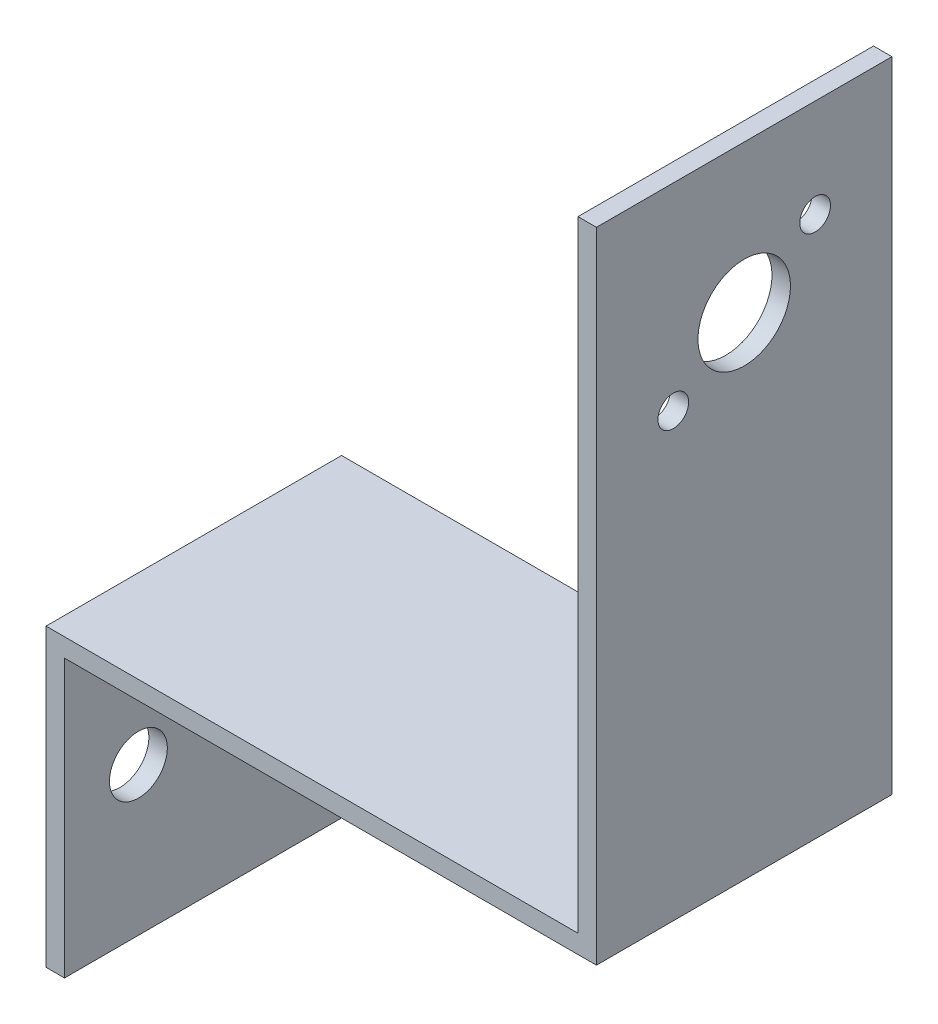
ISO-10303-21;
HEADER;
FILE_DESCRIPTION(('STEP AP214'),'2;1');
FILE_NAME('part.step','',(''),(''),'','','');
FILE_SCHEMA(('AUTOMOTIVE_DESIGN { 1 0 10303 214 1 1 1 1 }'));
ENDSEC;
DATA;
#1=APPLICATION_CONTEXT('core data for automotive mechanical design processes');
#2=APPLICATION_PROTOCOL_DEFINITION('international standard','automotive_design',2000,#1);
#3=PRODUCT_CONTEXT('',#1,'mechanical');
#4=PRODUCT('Part','Part','',(#3));
#5=PRODUCT_RELATED_PRODUCT_CATEGORY('part','',(#4));
#6=PRODUCT_DEFINITION_FORMATION('','',#4);
#7=PRODUCT_DEFINITION_CONTEXT('part definition',#1,'design');
#8=PRODUCT_DEFINITION('design','',#6,#7);
#9=PRODUCT_DEFINITION_SHAPE('','',#8);
#10=(LENGTH_UNIT() NAMED_UNIT(*) SI_UNIT(.MILLI.,.METRE.));
#11=(NAMED_UNIT(*) PLANE_ANGLE_UNIT() SI_UNIT($,.RADIAN.));
#12=(NAMED_UNIT(*) SI_UNIT($,.STERADIAN.) SOLID_ANGLE_UNIT());
#13=UNCERTAINTY_MEASURE_WITH_UNIT(LENGTH_MEASURE(1.E-05),#10,'distance_accuracy_value','');
#14=(GEOMETRIC_REPRESENTATION_CONTEXT(3) GLOBAL_UNCERTAINTY_ASSIGNED_CONTEXT((#13)) GLOBAL_UNIT_ASSIGNED_CONTEXT((#10,
#11,#12)) REPRESENTATION_CONTEXT('',''));
#15=CARTESIAN_POINT('',(0.,0.,0.));
#16=DIRECTION('',(0.,0.,1.));
#17=DIRECTION('',(1.,0.,0.));
#18=AXIS2_PLACEMENT_3D('',#15,#16,#17);
#19=CARTESIAN_POINT('',(47.307499936,25.4,25.4));
#20=DIRECTION('',(-1.,0.,0.));
#21=DIRECTION('',(0.,0.,1.));
#22=AXIS2_PLACEMENT_3D('',#19,#20,#21);
#23=PLANE('',#22);
#24=CARTESIAN_POINT('',(47.307499936,70.3086705546117,6.60370665599244));
#25=DIRECTION('',(1.,0.,0.));
#26=DIRECTION('',(0.,0.,-1.));
#27=AXIS2_PLACEMENT_3D('',#24,#25,#26);
#28=CIRCLE('',#27,1.3208);
#29=CARTESIAN_POINT('',(47.307499936,70.3086705546117,5.28290665599244));
#30=VERTEX_POINT('',#29);
#31=EDGE_CURVE('E202',#30,#30,#28,.T.);
#32=ORIENTED_EDGE('',*,*,#31,.F.);
#33=EDGE_LOOP('',(#32));
#34=FACE_BOUND('',#33,.T.);
#35=CARTESIAN_POINT('',(47.307499936,61.7713294453883,18.7962933440076));
#36=DIRECTION('',(1.,0.,0.));
#37=DIRECTION('',(0.,0.,-1.));
#38=AXIS2_PLACEMENT_3D('',#35,#36,#37);
#39=CIRCLE('',#38,1.32080000000001);
#40=CARTESIAN_POINT('',(47.307499936,61.7713294453883,17.4754933440075));
#41=VERTEX_POINT('',#40);
#42=EDGE_CURVE('E201',#41,#41,#39,.T.);
#43=ORIENTED_EDGE('',*,*,#42,.F.);
#44=EDGE_LOOP('',(#43));
#45=FACE_BOUND('',#44,.T.);
#46=CARTESIAN_POINT('',(47.307499936,66.04,12.7));
#47=DIRECTION('',(1.,0.,0.));
#48=DIRECTION('',(0.,0.,-1.));
#49=AXIS2_PLACEMENT_3D('',#46,#47,#48);
#50=CIRCLE('',#49,3.97509999999999);
#51=CARTESIAN_POINT('',(47.307499936,66.04,8.72490000000001));
#52=VERTEX_POINT('',#51);
#53=EDGE_CURVE('E162',#52,#52,#50,.T.);
#54=ORIENTED_EDGE('',*,*,#53,.F.);
#55=EDGE_LOOP('',(#54));
#56=FACE_BOUND('',#55,.T.);
#57=DIRECTION('',(0.,1.,0.));
#58=VECTOR('',#57,1.);
#59=CARTESIAN_POINT('',(47.307499936,25.4,0.));
#60=LINE('',#59,#58);
#61=CARTESIAN_POINT('',(47.307499936,23.8125,0.));
#62=VERTEX_POINT('',#61);
#63=CARTESIAN_POINT('',(47.307499936,78.74,0.));
#64=VERTEX_POINT('',#63);
#65=EDGE_CURVE('E133',#62,#64,#60,.T.);
#66=ORIENTED_EDGE('',*,*,#65,.T.);
#67=DIRECTION('',(0.,0.,-1.));
#68=VECTOR('',#67,1.);
#69=CARTESIAN_POINT('',(47.307499936,78.74,25.4));
#70=LINE('',#69,#68);
#71=CARTESIAN_POINT('',(47.307499936,78.74,25.4));
#72=VERTEX_POINT('',#71);
#73=EDGE_CURVE('E11',#72,#64,#70,.T.);
#74=ORIENTED_EDGE('',*,*,#73,.F.);
#75=DIRECTION('',(0.,1.,0.));
#76=VECTOR('',#75,1.);
#77=CARTESIAN_POINT('',(47.307499936,25.4,25.4));
#78=LINE('',#77,#76);
#79=CARTESIAN_POINT('',(47.307499936,23.8125,25.4));
#80=VERTEX_POINT('',#79);
#81=EDGE_CURVE('E91',#80,#72,#78,.T.);
#82=ORIENTED_EDGE('',*,*,#81,.F.);
#83=DIRECTION('',(0.,0.,-1.));
#84=VECTOR('',#83,1.);
#85=CARTESIAN_POINT('',(47.307499936,23.8125,25.4));
#86=LINE('',#85,#84);
#87=EDGE_CURVE('E132',#80,#62,#86,.T.);
#88=ORIENTED_EDGE('',*,*,#87,.T.);
#89=EDGE_LOOP('',(#66,#74,#82,#88));
#90=FACE_BOUND('',#89,.T.);
#91=ADVANCED_FACE('F34',(#34,#45,#56,#90),#23,.F.);
#92=CARTESIAN_POINT('',(45.719999936,78.74,25.4));
#93=DIRECTION('',(0.,1.,0.));
#94=DIRECTION('',(0.,0.,1.));
#95=AXIS2_PLACEMENT_3D('',#92,#93,#94);
#96=PLANE('',#95);
#97=DIRECTION('',(1.,0.,0.));
#98=VECTOR('',#97,1.);
#99=CARTESIAN_POINT('',(45.719999936,78.74,0.));
#100=LINE('',#99,#98);
#101=CARTESIAN_POINT('',(45.719999936,78.74,0.));
#102=VERTEX_POINT('',#101);
#103=EDGE_CURVE('E136',#102,#64,#100,.T.);
#104=ORIENTED_EDGE('',*,*,#103,.F.);
#105=DIRECTION('',(0.,0.,-1.));
#106=VECTOR('',#105,1.);
#107=CARTESIAN_POINT('',(45.719999936,78.74,25.4));
#108=LINE('',#107,#106);
#109=CARTESIAN_POINT('',(45.719999936,78.74,25.4));
#110=VERTEX_POINT('',#109);
#111=EDGE_CURVE('E43',#110,#102,#108,.T.);
#112=ORIENTED_EDGE('',*,*,#111,.F.);
#113=DIRECTION('',(1.,0.,0.));
#114=VECTOR('',#113,1.);
#115=CARTESIAN_POINT('',(45.719999936,78.74,25.4));
#116=LINE('',#115,#114);
#117=EDGE_CURVE('E193',#110,#72,#116,.T.);
#118=ORIENTED_EDGE('',*,*,#117,.T.);
#119=ORIENTED_EDGE('',*,*,#73,.T.);
#120=EDGE_LOOP('',(#104,#112,#118,#119));
#121=FACE_BOUND('',#120,.T.);
#122=ADVANCED_FACE('F176',(#121),#96,.T.);
#123=CARTESIAN_POINT('',(45.719999936,25.4,25.4));
#124=DIRECTION('',(-1.,0.,0.));
#125=DIRECTION('',(0.,0.,1.));
#126=AXIS2_PLACEMENT_3D('',#123,#124,#125);
#127=PLANE('',#126);
#128=CARTESIAN_POINT('',(45.719999936,70.3086705546117,6.60370665599244));
#129=DIRECTION('',(-1.,0.,0.));
#130=DIRECTION('',(0.,0.,1.));
#131=AXIS2_PLACEMENT_3D('',#128,#129,#130);
#132=CIRCLE('',#131,1.3208);
#133=CARTESIAN_POINT('',(45.719999936,70.3086705546117,7.92450665599245));
#134=VERTEX_POINT('',#133);
#135=EDGE_CURVE('E37',#134,#134,#132,.T.);
#136=ORIENTED_EDGE('',*,*,#135,.F.);
#137=EDGE_LOOP('',(#136));
#138=FACE_BOUND('',#137,.T.);
#139=CARTESIAN_POINT('',(45.719999936,61.7713294453883,18.7962933440076));
#140=DIRECTION('',(-1.,0.,0.));
#141=DIRECTION('',(0.,0.,1.));
#142=AXIS2_PLACEMENT_3D('',#139,#140,#141);
#143=CIRCLE('',#142,1.32080000000001);
#144=CARTESIAN_POINT('',(45.719999936,61.7713294453883,20.1170933440076));
#145=VERTEX_POINT('',#144);
#146=EDGE_CURVE('E161',#145,#145,#143,.T.);
#147=ORIENTED_EDGE('',*,*,#146,.F.);
#148=EDGE_LOOP('',(#147));
#149=FACE_BOUND('',#148,.T.);
#150=CARTESIAN_POINT('',(45.719999936,66.04,12.7));
#151=DIRECTION('',(-1.,0.,0.));
#152=DIRECTION('',(0.,0.,1.));
#153=AXIS2_PLACEMENT_3D('',#150,#151,#152);
#154=CIRCLE('',#153,3.97509999999999);
#155=CARTESIAN_POINT('',(45.719999936,66.04,16.6751));
#156=VERTEX_POINT('',#155);
#157=EDGE_CURVE('E159',#156,#156,#154,.T.);
#158=ORIENTED_EDGE('',*,*,#157,.F.);
#159=EDGE_LOOP('',(#158));
#160=FACE_BOUND('',#159,.T.);
#161=DIRECTION('',(0.,1.,0.));
#162=VECTOR('',#161,1.);
#163=CARTESIAN_POINT('',(45.719999936,25.4,0.));
#164=LINE('',#163,#162);
#165=CARTESIAN_POINT('',(45.719999936,25.4,0.));
#166=VERTEX_POINT('',#165);
#167=EDGE_CURVE('E139',#166,#102,#164,.T.);
#168=ORIENTED_EDGE('',*,*,#167,.F.);
#169=DIRECTION('',(0.,0.,-1.));
#170=VECTOR('',#169,1.);
#171=CARTESIAN_POINT('',(45.719999936,25.4,25.4));
#172=LINE('',#171,#170);
#173=CARTESIAN_POINT('',(45.719999936,25.4,25.4));
#174=VERTEX_POINT('',#173);
#175=EDGE_CURVE('E156',#174,#166,#172,.T.);
#176=ORIENTED_EDGE('',*,*,#175,.F.);
#177=DIRECTION('',(0.,1.,0.));
#178=VECTOR('',#177,1.);
#179=CARTESIAN_POINT('',(45.719999936,25.4,25.4));
#180=LINE('',#179,#178);
#181=EDGE_CURVE('E192',#174,#110,#180,.T.);
#182=ORIENTED_EDGE('',*,*,#181,.T.);
#183=ORIENTED_EDGE('',*,*,#111,.T.);
#184=EDGE_LOOP('',(#168,#176,#182,#183));
#185=FACE_BOUND('',#184,.T.);
#186=ADVANCED_FACE('F172',(#138,#149,#160,#185),#127,.T.);
#187=CARTESIAN_POINT('',(0.,25.4,25.4));
#188=DIRECTION('',(0.,1.,0.));
#189=DIRECTION('',(0.,0.,1.));
#190=AXIS2_PLACEMENT_3D('',#187,#188,#189);
#191=PLANE('',#190);
#192=DIRECTION('',(1.,0.,0.));
#193=VECTOR('',#192,1.);
#194=CARTESIAN_POINT('',(0.,25.4,0.));
#195=LINE('',#194,#193);
#196=CARTESIAN_POINT('',(0.,25.4,0.));
#197=VERTEX_POINT('',#196);
#198=EDGE_CURVE('E142',#197,#166,#195,.T.);
#199=ORIENTED_EDGE('',*,*,#198,.F.);
#200=DIRECTION('',(0.,0.,-1.));
#201=VECTOR('',#200,1.);
#202=CARTESIAN_POINT('',(0.,25.4,25.4));
#203=LINE('',#202,#201);
#204=CARTESIAN_POINT('',(0.,25.4,25.4));
#205=VERTEX_POINT('',#204);
#206=EDGE_CURVE('E154',#205,#197,#203,.T.);
#207=ORIENTED_EDGE('',*,*,#206,.F.);
#208=DIRECTION('',(1.,0.,0.));
#209=VECTOR('',#208,1.);
#210=CARTESIAN_POINT('',(0.,25.4,25.4));
#211=LINE('',#210,#209);
#212=EDGE_CURVE('E127',#205,#174,#211,.T.);
#213=ORIENTED_EDGE('',*,*,#212,.T.);
#214=ORIENTED_EDGE('',*,*,#175,.T.);
#215=EDGE_LOOP('',(#199,#207,#213,#214));
#216=FACE_BOUND('',#215,.T.);
#217=ADVANCED_FACE('F175',(#216),#191,.T.);
#218=CARTESIAN_POINT('',(0.,0.,25.4));
#219=DIRECTION('',(-1.,0.,0.));
#220=DIRECTION('',(0.,0.,1.));
#221=AXIS2_PLACEMENT_3D('',#218,#219,#220);
#222=PLANE('',#221);
#223=CARTESIAN_POINT('',(0.,12.7,19.05));
#224=DIRECTION('',(1.,0.,0.));
#225=DIRECTION('',(0.,0.,-1.));
#226=AXIS2_PLACEMENT_3D('',#223,#224,#225);
#227=CIRCLE('',#226,2.4892);
#228=CARTESIAN_POINT('',(0.,12.7,16.5608));
#229=VERTEX_POINT('',#228);
#230=EDGE_CURVE('E205',#229,#229,#227,.T.);
#231=ORIENTED_EDGE('',*,*,#230,.T.);
#232=EDGE_LOOP('',(#231));
#233=FACE_BOUND('',#232,.T.);
#234=CARTESIAN_POINT('',(0.,12.7,6.35));
#235=DIRECTION('',(1.,0.,0.));
#236=DIRECTION('',(0.,0.,-1.));
#237=AXIS2_PLACEMENT_3D('',#234,#235,#236);
#238=CIRCLE('',#237,2.4892);
#239=CARTESIAN_POINT('',(0.,12.7,3.8608));
#240=VERTEX_POINT('',#239);
#241=EDGE_CURVE('E211',#240,#240,#238,.T.);
#242=ORIENTED_EDGE('',*,*,#241,.T.);
#243=EDGE_LOOP('',(#242));
#244=FACE_BOUND('',#243,.T.);
#245=DIRECTION('',(0.,1.,0.));
#246=VECTOR('',#245,1.);
#247=CARTESIAN_POINT('',(0.,0.,0.));
#248=LINE('',#247,#246);
#249=CARTESIAN_POINT('',(0.,0.,0.));
#250=VERTEX_POINT('',#249);
#251=EDGE_CURVE('E145',#250,#197,#248,.T.);
#252=ORIENTED_EDGE('',*,*,#251,.F.);
#253=DIRECTION('',(0.,0.,-1.));
#254=VECTOR('',#253,1.);
#255=CARTESIAN_POINT('',(0.,0.,25.4));
#256=LINE('',#255,#254);
#257=CARTESIAN_POINT('',(0.,0.,25.4));
#258=VERTEX_POINT('',#257);
#259=EDGE_CURVE('E115',#258,#250,#256,.T.);
#260=ORIENTED_EDGE('',*,*,#259,.F.);
#261=DIRECTION('',(0.,1.,0.));
#262=VECTOR('',#261,1.);
#263=CARTESIAN_POINT('',(0.,0.,25.4));
#264=LINE('',#263,#262);
#265=EDGE_CURVE('E125',#258,#205,#264,.T.);
#266=ORIENTED_EDGE('',*,*,#265,.T.);
#267=ORIENTED_EDGE('',*,*,#206,.T.);
#268=EDGE_LOOP('',(#252,#260,#266,#267));
#269=FACE_BOUND('',#268,.T.);
#270=ADVANCED_FACE('F220',(#233,#244,#269),#222,.T.);
#271=CARTESIAN_POINT('',(1.5875,0.,25.4));
#272=DIRECTION('',(0.,-1.,0.));
#273=DIRECTION('',(0.,0.,-1.));
#274=AXIS2_PLACEMENT_3D('',#271,#272,#273);
#275=PLANE('',#274);
#276=DIRECTION('',(-1.,0.,0.));
#277=VECTOR('',#276,1.);
#278=CARTESIAN_POINT('',(1.5875,0.,0.));
#279=LINE('',#278,#277);
#280=CARTESIAN_POINT('',(1.5875,0.,0.));
#281=VERTEX_POINT('',#280);
#282=EDGE_CURVE('E114',#281,#250,#279,.T.);
#283=ORIENTED_EDGE('',*,*,#282,.F.);
#284=DIRECTION('',(0.,0.,-1.));
#285=VECTOR('',#284,1.);
#286=CARTESIAN_POINT('',(1.5875,0.,25.4));
#287=LINE('',#286,#285);
#288=CARTESIAN_POINT('',(1.5875,0.,25.4));
#289=VERTEX_POINT('',#288);
#290=EDGE_CURVE('E108',#289,#281,#287,.T.);
#291=ORIENTED_EDGE('',*,*,#290,.F.);
#292=DIRECTION('',(-1.,0.,0.));
#293=VECTOR('',#292,1.);
#294=CARTESIAN_POINT('',(1.5875,0.,25.4));
#295=LINE('',#294,#293);
#296=EDGE_CURVE('E112',#289,#258,#295,.T.);
#297=ORIENTED_EDGE('',*,*,#296,.T.);
#298=ORIENTED_EDGE('',*,*,#259,.T.);
#299=EDGE_LOOP('',(#283,#291,#297,#298));
#300=FACE_BOUND('',#299,.T.);
#301=ADVANCED_FACE('F110',(#300),#275,.T.);
#302=CARTESIAN_POINT('',(1.5875,0.,25.4));
#303=DIRECTION('',(-1.,0.,0.));
#304=DIRECTION('',(0.,0.,1.));
#305=AXIS2_PLACEMENT_3D('',#302,#303,#304);
#306=PLANE('',#305);
#307=CARTESIAN_POINT('',(1.5875,12.7,19.05));
#308=DIRECTION('',(1.,0.,0.));
#309=DIRECTION('',(0.,0.,-1.));
#310=AXIS2_PLACEMENT_3D('',#307,#308,#309);
#311=CIRCLE('',#310,2.4892);
#312=CARTESIAN_POINT('',(1.5875,12.7,16.5608));
#313=VERTEX_POINT('',#312);
#314=EDGE_CURVE('E214',#313,#313,#311,.T.);
#315=ORIENTED_EDGE('',*,*,#314,.F.);
#316=EDGE_LOOP('',(#315));
#317=FACE_BOUND('',#316,.T.);
#318=CARTESIAN_POINT('',(1.5875,12.7,6.35));
#319=DIRECTION('',(1.,0.,0.));
#320=DIRECTION('',(0.,0.,-1.));
#321=AXIS2_PLACEMENT_3D('',#318,#319,#320);
#322=CIRCLE('',#321,2.4892);
#323=CARTESIAN_POINT('',(1.5875,12.7,3.8608));
#324=VERTEX_POINT('',#323);
#325=EDGE_CURVE('E208',#324,#324,#322,.T.);
#326=ORIENTED_EDGE('',*,*,#325,.F.);
#327=EDGE_LOOP('',(#326));
#328=FACE_BOUND('',#327,.T.);
#329=DIRECTION('',(0.,1.,0.));
#330=VECTOR('',#329,1.);
#331=CARTESIAN_POINT('',(1.5875,0.,0.));
#332=LINE('',#331,#330);
#333=CARTESIAN_POINT('',(1.5875,23.8125,0.));
#334=VERTEX_POINT('',#333);
#335=EDGE_CURVE('E79',#281,#334,#332,.T.);
#336=ORIENTED_EDGE('',*,*,#335,.T.);
#337=DIRECTION('',(0.,0.,-1.));
#338=VECTOR('',#337,1.);
#339=CARTESIAN_POINT('',(1.5875,23.8125,25.4));
#340=LINE('',#339,#338);
#341=CARTESIAN_POINT('',(1.5875,23.8125,25.4));
#342=VERTEX_POINT('',#341);
#343=EDGE_CURVE('E116',#342,#334,#340,.T.);
#344=ORIENTED_EDGE('',*,*,#343,.F.);
#345=DIRECTION('',(0.,1.,0.));
#346=VECTOR('',#345,1.);
#347=CARTESIAN_POINT('',(1.5875,0.,25.4));
#348=LINE('',#347,#346);
#349=EDGE_CURVE('E118',#289,#342,#348,.T.);
#350=ORIENTED_EDGE('',*,*,#349,.F.);
#351=ORIENTED_EDGE('',*,*,#290,.T.);
#352=EDGE_LOOP('',(#336,#344,#350,#351));
#353=FACE_BOUND('',#352,.T.);
#354=ADVANCED_FACE('F119',(#317,#328,#353),#306,.F.);
#355=CARTESIAN_POINT('',(0.,23.8125,25.4));
#356=DIRECTION('',(0.,1.,0.));
#357=DIRECTION('',(0.,0.,1.));
#358=AXIS2_PLACEMENT_3D('',#355,#356,#357);
#359=PLANE('',#358);
#360=DIRECTION('',(1.,0.,0.));
#361=VECTOR('',#360,1.);
#362=CARTESIAN_POINT('',(0.,23.8125,0.));
#363=LINE('',#362,#361);
#364=EDGE_CURVE('E85',#334,#62,#363,.T.);
#365=ORIENTED_EDGE('',*,*,#364,.T.);
#366=ORIENTED_EDGE('',*,*,#87,.F.);
#367=DIRECTION('',(1.,0.,0.));
#368=VECTOR('',#367,1.);
#369=CARTESIAN_POINT('',(0.,23.8125,25.4));
#370=LINE('',#369,#368);
#371=EDGE_CURVE('E52',#342,#80,#370,.T.);
#372=ORIENTED_EDGE('',*,*,#371,.F.);
#373=ORIENTED_EDGE('',*,*,#343,.T.);
#374=EDGE_LOOP('',(#365,#366,#372,#373));
#375=FACE_BOUND('',#374,.T.);
#376=ADVANCED_FACE('F232',(#375),#359,.F.);
#377=CARTESIAN_POINT('',(0.,0.,25.4));
#378=DIRECTION('',(0.,0.,-1.));
#379=DIRECTION('',(-1.,0.,0.));
#380=AXIS2_PLACEMENT_3D('',#377,#378,#379);
#381=PLANE('',#380);
#382=ORIENTED_EDGE('',*,*,#81,.T.);
#383=ORIENTED_EDGE('',*,*,#117,.F.);
#384=ORIENTED_EDGE('',*,*,#181,.F.);
#385=ORIENTED_EDGE('',*,*,#212,.F.);
#386=ORIENTED_EDGE('',*,*,#265,.F.);
#387=ORIENTED_EDGE('',*,*,#296,.F.);
#388=ORIENTED_EDGE('',*,*,#349,.T.);
#389=ORIENTED_EDGE('',*,*,#371,.T.);
#390=EDGE_LOOP('',(#382,#383,#384,#385,#386,#387,#388,#389));
#391=FACE_BOUND('',#390,.T.);
#392=ADVANCED_FACE('F122',(#391),#381,.F.);
#393=CARTESIAN_POINT('',(0.,0.,0.));
#394=DIRECTION('',(0.,0.,-1.));
#395=DIRECTION('',(-1.,0.,0.));
#396=AXIS2_PLACEMENT_3D('',#393,#394,#395);
#397=PLANE('',#396);
#398=ORIENTED_EDGE('',*,*,#65,.F.);
#399=ORIENTED_EDGE('',*,*,#364,.F.);
#400=ORIENTED_EDGE('',*,*,#335,.F.);
#401=ORIENTED_EDGE('',*,*,#282,.T.);
#402=ORIENTED_EDGE('',*,*,#251,.T.);
#403=ORIENTED_EDGE('',*,*,#198,.T.);
#404=ORIENTED_EDGE('',*,*,#167,.T.);
#405=ORIENTED_EDGE('',*,*,#103,.T.);
#406=EDGE_LOOP('',(#398,#399,#400,#401,#402,#403,#404,#405));
#407=FACE_BOUND('',#406,.T.);
#408=ADVANCED_FACE('F188',(#407),#397,.T.);
#409=CARTESIAN_POINT('',(0.,66.04,12.7));
#410=DIRECTION('',(1.,0.,0.));
#411=DIRECTION('',(0.,0.,-1.));
#412=AXIS2_PLACEMENT_3D('',#409,#410,#411);
#413=CYLINDRICAL_SURFACE('',#412,3.97509999999999);
#414=ORIENTED_EDGE('',*,*,#157,.T.);
#415=EDGE_LOOP('',(#414));
#416=FACE_BOUND('',#415,.T.);
#417=ORIENTED_EDGE('',*,*,#53,.T.);
#418=EDGE_LOOP('',(#417));
#419=FACE_BOUND('',#418,.T.);
#420=ADVANCED_FACE('F314',(#416,#419),#413,.F.);
#421=CARTESIAN_POINT('',(0.,61.7713294453883,18.7962933440076));
#422=DIRECTION('',(1.,0.,0.));
#423=DIRECTION('',(0.,0.,-1.));
#424=AXIS2_PLACEMENT_3D('',#421,#422,#423);
#425=CYLINDRICAL_SURFACE('',#424,1.32080000000001);
#426=ORIENTED_EDGE('',*,*,#146,.T.);
#427=EDGE_LOOP('',(#426));
#428=FACE_BOUND('',#427,.T.);
#429=ORIENTED_EDGE('',*,*,#42,.T.);
#430=EDGE_LOOP('',(#429));
#431=FACE_BOUND('',#430,.T.);
#432=ADVANCED_FACE('F242',(#428,#431),#425,.F.);
#433=CARTESIAN_POINT('',(0.,70.3086705546117,6.60370665599244));
#434=DIRECTION('',(1.,0.,0.));
#435=DIRECTION('',(0.,0.,-1.));
#436=AXIS2_PLACEMENT_3D('',#433,#434,#435);
#437=CYLINDRICAL_SURFACE('',#436,1.3208);
#438=ORIENTED_EDGE('',*,*,#135,.T.);
#439=EDGE_LOOP('',(#438));
#440=FACE_BOUND('',#439,.T.);
#441=ORIENTED_EDGE('',*,*,#31,.T.);
#442=EDGE_LOOP('',(#441));
#443=FACE_BOUND('',#442,.T.);
#444=ADVANCED_FACE('F169',(#440,#443),#437,.F.);
#445=CARTESIAN_POINT('',(0.,12.7,6.35));
#446=DIRECTION('',(1.,0.,0.));
#447=DIRECTION('',(0.,0.,-1.));
#448=AXIS2_PLACEMENT_3D('',#445,#446,#447);
#449=CYLINDRICAL_SURFACE('',#448,2.4892);
#450=ORIENTED_EDGE('',*,*,#241,.F.);
#451=EDGE_LOOP('',(#450));
#452=FACE_BOUND('',#451,.T.);
#453=ORIENTED_EDGE('',*,*,#325,.T.);
#454=EDGE_LOOP('',(#453));
#455=FACE_BOUND('',#454,.T.);
#456=ADVANCED_FACE('F226',(#452,#455),#449,.F.);
#457=CARTESIAN_POINT('',(0.,12.7,19.05));
#458=DIRECTION('',(1.,0.,0.));
#459=DIRECTION('',(0.,0.,-1.));
#460=AXIS2_PLACEMENT_3D('',#457,#458,#459);
#461=CYLINDRICAL_SURFACE('',#460,2.4892);
#462=ORIENTED_EDGE('',*,*,#230,.F.);
#463=EDGE_LOOP('',(#462));
#464=FACE_BOUND('',#463,.T.);
#465=ORIENTED_EDGE('',*,*,#314,.T.);
#466=EDGE_LOOP('',(#465));
#467=FACE_BOUND('',#466,.T.);
#468=ADVANCED_FACE('F223',(#464,#467),#461,.F.);
#469=CLOSED_SHELL('',(#91,#122,#186,#217,#270,#301,#354,#376,#392,#408,#420,#432,#444,#456,#468));
#470=MANIFOLD_SOLID_BREP('B2',#469);
#471=ADVANCED_BREP_SHAPE_REPRESENTATION('',(#18,#470),#14);
#472=SHAPE_DEFINITION_REPRESENTATION(#9,#471);
ENDSEC;
END-ISO-10303-21;
